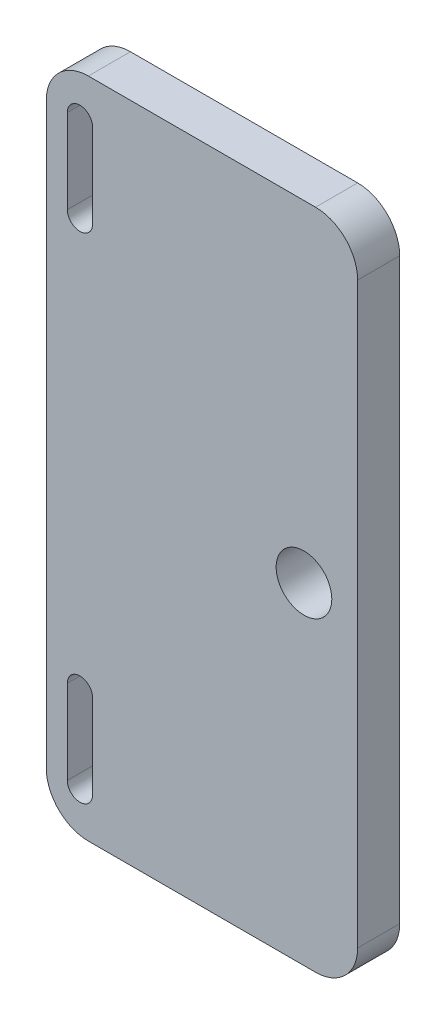
ISO-10303-21;
HEADER;
FILE_DESCRIPTION(('STEP AP214'),'2;1');
FILE_NAME('part.step','',(''),(''),'','','');
FILE_SCHEMA(('AUTOMOTIVE_DESIGN { 1 0 10303 214 1 1 1 1 }'));
ENDSEC;
DATA;
#1=APPLICATION_CONTEXT('core data for automotive mechanical design processes');
#2=APPLICATION_PROTOCOL_DEFINITION('international standard','automotive_design',2000,#1);
#3=PRODUCT_CONTEXT('',#1,'mechanical');
#4=PRODUCT('Part','Part','',(#3));
#5=PRODUCT_RELATED_PRODUCT_CATEGORY('part','',(#4));
#6=PRODUCT_DEFINITION_FORMATION('','',#4);
#7=PRODUCT_DEFINITION_CONTEXT('part definition',#1,'design');
#8=PRODUCT_DEFINITION('design','',#6,#7);
#9=PRODUCT_DEFINITION_SHAPE('','',#8);
#10=(LENGTH_UNIT() NAMED_UNIT(*) SI_UNIT(.MILLI.,.METRE.));
#11=(NAMED_UNIT(*) PLANE_ANGLE_UNIT() SI_UNIT($,.RADIAN.));
#12=(NAMED_UNIT(*) SI_UNIT($,.STERADIAN.) SOLID_ANGLE_UNIT());
#13=UNCERTAINTY_MEASURE_WITH_UNIT(LENGTH_MEASURE(1.E-05),#10,'distance_accuracy_value','');
#14=(GEOMETRIC_REPRESENTATION_CONTEXT(3) GLOBAL_UNCERTAINTY_ASSIGNED_CONTEXT((#13)) GLOBAL_UNIT_ASSIGNED_CONTEXT((#10,
#11,#12)) REPRESENTATION_CONTEXT('',''));
#15=CARTESIAN_POINT('',(0.,0.,0.));
#16=DIRECTION('',(0.,0.,1.));
#17=DIRECTION('',(1.,0.,0.));
#18=AXIS2_PLACEMENT_3D('',#15,#16,#17);
#19=CARTESIAN_POINT('',(0.,0.,3.175));
#20=DIRECTION('',(0.,0.,-1.));
#21=DIRECTION('',(-1.,0.,0.));
#22=AXIS2_PLACEMENT_3D('',#19,#20,#21);
#23=PLANE('',#22);
#24=DIRECTION('',(0.,-1.,0.));
#25=VECTOR('',#24,1.);
#26=CARTESIAN_POINT('',(-27.8575,-15.475,3.175));
#27=LINE('',#26,#25);
#28=CARTESIAN_POINT('',(-27.8575,-15.475,3.175));
#29=VERTEX_POINT('',#28);
#30=CARTESIAN_POINT('',(-27.8575,-21.825,3.175));
#31=VERTEX_POINT('',#30);
#32=EDGE_CURVE('E190',#29,#31,#27,.T.);
#33=ORIENTED_EDGE('',*,*,#32,.F.);
#34=CARTESIAN_POINT('',(-26.905,-15.475,3.175));
#35=DIRECTION('',(0.,0.,1.));
#36=DIRECTION('',(1.,0.,0.));
#37=AXIS2_PLACEMENT_3D('',#34,#35,#36);
#38=CIRCLE('',#37,0.952499999999998);
#39=CARTESIAN_POINT('',(-25.9525,-15.475,3.175));
#40=VERTEX_POINT('',#39);
#41=EDGE_CURVE('E163',#40,#29,#38,.T.);
#42=ORIENTED_EDGE('',*,*,#41,.F.);
#43=DIRECTION('',(0.,1.,0.));
#44=VECTOR('',#43,1.);
#45=CARTESIAN_POINT('',(-25.9525,-15.475,3.175));
#46=LINE('',#45,#44);
#47=CARTESIAN_POINT('',(-25.9525,-21.825,3.175));
#48=VERTEX_POINT('',#47);
#49=EDGE_CURVE('E181',#48,#40,#46,.T.);
#50=ORIENTED_EDGE('',*,*,#49,.F.);
#51=CARTESIAN_POINT('',(-26.905,-21.825,3.175));
#52=DIRECTION('',(0.,0.,1.));
#53=DIRECTION('',(1.,0.,0.));
#54=AXIS2_PLACEMENT_3D('',#51,#52,#53);
#55=CIRCLE('',#54,0.952499999999998);
#56=EDGE_CURVE('E184',#31,#48,#55,.T.);
#57=ORIENTED_EDGE('',*,*,#56,.F.);
#58=EDGE_LOOP('',(#33,#42,#50,#57));
#59=FACE_BOUND('',#58,.T.);
#60=DIRECTION('',(0.,1.,0.));
#61=VECTOR('',#60,1.);
#62=CARTESIAN_POINT('',(-25.9525,15.475,3.175));
#63=LINE('',#62,#61);
#64=CARTESIAN_POINT('',(-25.9525,15.475,3.175));
#65=VERTEX_POINT('',#64);
#66=CARTESIAN_POINT('',(-25.9525000000001,21.825,3.175));
#67=VERTEX_POINT('',#66);
#68=EDGE_CURVE('E218',#65,#67,#63,.T.);
#69=ORIENTED_EDGE('',*,*,#68,.F.);
#70=CARTESIAN_POINT('',(-26.905,15.475,3.175));
#71=DIRECTION('',(0.,0.,1.));
#72=DIRECTION('',(-1.,0.,0.));
#73=AXIS2_PLACEMENT_3D('',#70,#71,#72);
#74=CIRCLE('',#73,0.952499999999998);
#75=CARTESIAN_POINT('',(-27.8575,15.475,3.175));
#76=VERTEX_POINT('',#75);
#77=EDGE_CURVE('E191',#76,#65,#74,.T.);
#78=ORIENTED_EDGE('',*,*,#77,.F.);
#79=DIRECTION('',(0.,-1.,0.));
#80=VECTOR('',#79,1.);
#81=CARTESIAN_POINT('',(-27.8575,15.475,3.175));
#82=LINE('',#81,#80);
#83=CARTESIAN_POINT('',(-27.8575000000001,21.825,3.175));
#84=VERTEX_POINT('',#83);
#85=EDGE_CURVE('E211',#84,#76,#82,.T.);
#86=ORIENTED_EDGE('',*,*,#85,.F.);
#87=CARTESIAN_POINT('',(-26.9050000000001,21.825,3.175));
#88=DIRECTION('',(0.,0.,1.));
#89=DIRECTION('',(-1.,0.,0.));
#90=AXIS2_PLACEMENT_3D('',#87,#88,#89);
#91=CIRCLE('',#90,0.952499999999998);
#92=EDGE_CURVE('E214',#67,#84,#91,.T.);
#93=ORIENTED_EDGE('',*,*,#92,.F.);
#94=EDGE_LOOP('',(#69,#78,#86,#93));
#95=FACE_BOUND('',#94,.T.);
#96=DIRECTION('',(0.,-1.,0.));
#97=VECTOR('',#96,1.);
#98=CARTESIAN_POINT('',(-29.445,-25.,3.175));
#99=LINE('',#98,#97);
#100=CARTESIAN_POINT('',(-29.445,21.825,3.175));
#101=VERTEX_POINT('',#100);
#102=CARTESIAN_POINT('',(-29.445,-21.825,3.175));
#103=VERTEX_POINT('',#102);
#104=EDGE_CURVE('E197',#101,#103,#99,.T.);
#105=ORIENTED_EDGE('',*,*,#104,.T.);
#106=CARTESIAN_POINT('',(-26.27,-21.825,3.175));
#107=DIRECTION('',(0.,0.,-1.));
#108=DIRECTION('',(-1.,0.,0.));
#109=AXIS2_PLACEMENT_3D('',#106,#107,#108);
#110=CIRCLE('',#109,3.175);
#111=CARTESIAN_POINT('',(-26.27,-25.,3.175));
#112=VERTEX_POINT('',#111);
#113=EDGE_CURVE('E271',#103,#112,#110,.F.);
#114=ORIENTED_EDGE('',*,*,#113,.T.);
#115=DIRECTION('',(1.,0.,0.));
#116=VECTOR('',#115,1.);
#117=CARTESIAN_POINT('',(-5.94999999999999,-25.,3.175));
#118=LINE('',#117,#116);
#119=CARTESIAN_POINT('',(-9.12499999999999,-25.,3.175));
#120=VERTEX_POINT('',#119);
#121=EDGE_CURVE('E247',#112,#120,#118,.T.);
#122=ORIENTED_EDGE('',*,*,#121,.T.);
#123=CARTESIAN_POINT('',(-9.12499999999999,-21.825,3.175));
#124=DIRECTION('',(0.,0.,-1.));
#125=DIRECTION('',(-1.,0.,0.));
#126=AXIS2_PLACEMENT_3D('',#123,#124,#125);
#127=CIRCLE('',#126,3.175);
#128=CARTESIAN_POINT('',(-5.94999999999999,-21.825,3.175));
#129=VERTEX_POINT('',#128);
#130=EDGE_CURVE('E269',#120,#129,#127,.F.);
#131=ORIENTED_EDGE('',*,*,#130,.T.);
#132=DIRECTION('',(0.,1.,0.));
#133=VECTOR('',#132,1.);
#134=CARTESIAN_POINT('',(-5.95,25.,3.175));
#135=LINE('',#134,#133);
#136=CARTESIAN_POINT('',(-5.95,21.825,3.175));
#137=VERTEX_POINT('',#136);
#138=EDGE_CURVE('E251',#129,#137,#135,.T.);
#139=ORIENTED_EDGE('',*,*,#138,.T.);
#140=CARTESIAN_POINT('',(-9.125,21.825,3.175));
#141=DIRECTION('',(0.,0.,-1.));
#142=DIRECTION('',(-1.,0.,0.));
#143=AXIS2_PLACEMENT_3D('',#140,#141,#142);
#144=CIRCLE('',#143,3.175);
#145=CARTESIAN_POINT('',(-9.12500000000001,25.,3.175));
#146=VERTEX_POINT('',#145);
#147=EDGE_CURVE('E265',#137,#146,#144,.F.);
#148=ORIENTED_EDGE('',*,*,#147,.T.);
#149=DIRECTION('',(-1.,0.,0.));
#150=VECTOR('',#149,1.);
#151=CARTESIAN_POINT('',(-25.,25.,3.175));
#152=LINE('',#151,#150);
#153=CARTESIAN_POINT('',(-26.27,25.,3.175));
#154=VERTEX_POINT('',#153);
#155=EDGE_CURVE('E244',#146,#154,#152,.T.);
#156=ORIENTED_EDGE('',*,*,#155,.T.);
#157=CARTESIAN_POINT('',(-26.27,21.825,3.175));
#158=DIRECTION('',(0.,0.,-1.));
#159=DIRECTION('',(-1.,0.,0.));
#160=AXIS2_PLACEMENT_3D('',#157,#158,#159);
#161=CIRCLE('',#160,3.175);
#162=EDGE_CURVE('E267',#154,#101,#161,.F.);
#163=ORIENTED_EDGE('',*,*,#162,.T.);
#164=EDGE_LOOP('',(#105,#114,#122,#131,#139,#148,#156,#163));
#165=FACE_BOUND('',#164,.T.);
#166=CARTESIAN_POINT('',(-10.,0.,3.175));
#167=DIRECTION('',(0.,0.,1.));
#168=DIRECTION('',(1.,0.,0.));
#169=AXIS2_PLACEMENT_3D('',#166,#167,#168);
#170=CIRCLE('',#169,2.1);
#171=CARTESIAN_POINT('',(-7.9,0.,3.175));
#172=VERTEX_POINT('',#171);
#173=EDGE_CURVE('E238',#172,#172,#170,.T.);
#174=ORIENTED_EDGE('',*,*,#173,.F.);
#175=EDGE_LOOP('',(#174));
#176=FACE_BOUND('',#175,.T.);
#177=ADVANCED_FACE('F41',(#59,#95,#165,#176),#23,.F.);
#178=CARTESIAN_POINT('',(0.,0.,0.));
#179=DIRECTION('',(0.,0.,-1.));
#180=DIRECTION('',(-1.,0.,0.));
#181=AXIS2_PLACEMENT_3D('',#178,#179,#180);
#182=PLANE('',#181);
#183=CARTESIAN_POINT('',(-26.905,-15.475,0.));
#184=DIRECTION('',(0.,0.,1.));
#185=DIRECTION('',(1.,0.,0.));
#186=AXIS2_PLACEMENT_3D('',#183,#184,#185);
#187=CIRCLE('',#186,0.952499999999998);
#188=CARTESIAN_POINT('',(-25.9525,-15.475,0.));
#189=VERTEX_POINT('',#188);
#190=CARTESIAN_POINT('',(-27.8575,-15.475,0.));
#191=VERTEX_POINT('',#190);
#192=EDGE_CURVE('E160',#189,#191,#187,.T.);
#193=ORIENTED_EDGE('',*,*,#192,.T.);
#194=DIRECTION('',(0.,-1.,0.));
#195=VECTOR('',#194,1.);
#196=CARTESIAN_POINT('',(-27.8575,-15.475,0.));
#197=LINE('',#196,#195);
#198=CARTESIAN_POINT('',(-27.8575,-21.825,0.));
#199=VERTEX_POINT('',#198);
#200=EDGE_CURVE('E172',#191,#199,#197,.T.);
#201=ORIENTED_EDGE('',*,*,#200,.T.);
#202=CARTESIAN_POINT('',(-26.905,-21.825,0.));
#203=DIRECTION('',(0.,0.,1.));
#204=DIRECTION('',(1.,0.,0.));
#205=AXIS2_PLACEMENT_3D('',#202,#203,#204);
#206=CIRCLE('',#205,0.952499999999998);
#207=CARTESIAN_POINT('',(-25.9525,-21.825,0.));
#208=VERTEX_POINT('',#207);
#209=EDGE_CURVE('E176',#199,#208,#206,.T.);
#210=ORIENTED_EDGE('',*,*,#209,.T.);
#211=DIRECTION('',(0.,1.,0.));
#212=VECTOR('',#211,1.);
#213=CARTESIAN_POINT('',(-25.9525,-15.475,0.));
#214=LINE('',#213,#212);
#215=EDGE_CURVE('E168',#208,#189,#214,.T.);
#216=ORIENTED_EDGE('',*,*,#215,.T.);
#217=EDGE_LOOP('',(#193,#201,#210,#216));
#218=FACE_BOUND('',#217,.T.);
#219=CARTESIAN_POINT('',(-26.905,15.475,0.));
#220=DIRECTION('',(0.,0.,1.));
#221=DIRECTION('',(-1.,0.,0.));
#222=AXIS2_PLACEMENT_3D('',#219,#220,#221);
#223=CIRCLE('',#222,0.952499999999998);
#224=CARTESIAN_POINT('',(-27.8575,15.475,0.));
#225=VERTEX_POINT('',#224);
#226=CARTESIAN_POINT('',(-25.9525,15.475,0.));
#227=VERTEX_POINT('',#226);
#228=EDGE_CURVE('E215',#225,#227,#223,.T.);
#229=ORIENTED_EDGE('',*,*,#228,.T.);
#230=DIRECTION('',(0.,1.,0.));
#231=VECTOR('',#230,1.);
#232=CARTESIAN_POINT('',(-25.9525,15.475,0.));
#233=LINE('',#232,#231);
#234=CARTESIAN_POINT('',(-25.9525000000001,21.825,0.));
#235=VERTEX_POINT('',#234);
#236=EDGE_CURVE('E227',#227,#235,#233,.T.);
#237=ORIENTED_EDGE('',*,*,#236,.T.);
#238=CARTESIAN_POINT('',(-26.9050000000001,21.825,0.));
#239=DIRECTION('',(0.,0.,1.));
#240=DIRECTION('',(-1.,0.,0.));
#241=AXIS2_PLACEMENT_3D('',#238,#239,#240);
#242=CIRCLE('',#241,0.952499999999998);
#243=CARTESIAN_POINT('',(-27.8575000000001,21.825,0.));
#244=VERTEX_POINT('',#243);
#245=EDGE_CURVE('E224',#235,#244,#242,.T.);
#246=ORIENTED_EDGE('',*,*,#245,.T.);
#247=DIRECTION('',(0.,-1.,0.));
#248=VECTOR('',#247,1.);
#249=CARTESIAN_POINT('',(-27.8575,15.475,0.));
#250=LINE('',#249,#248);
#251=EDGE_CURVE('E204',#244,#225,#250,.T.);
#252=ORIENTED_EDGE('',*,*,#251,.T.);
#253=EDGE_LOOP('',(#229,#237,#246,#252));
#254=FACE_BOUND('',#253,.T.);
#255=DIRECTION('',(1.,0.,0.));
#256=VECTOR('',#255,1.);
#257=CARTESIAN_POINT('',(-5.94999999999999,-25.,0.));
#258=LINE('',#257,#256);
#259=CARTESIAN_POINT('',(-26.27,-25.,0.));
#260=VERTEX_POINT('',#259);
#261=CARTESIAN_POINT('',(-9.12499999999999,-25.,0.));
#262=VERTEX_POINT('',#261);
#263=EDGE_CURVE('E257',#260,#262,#258,.T.);
#264=ORIENTED_EDGE('',*,*,#263,.F.);
#265=CARTESIAN_POINT('',(-26.27,-21.825,0.));
#266=DIRECTION('',(0.,0.,-1.));
#267=DIRECTION('',(-1.,0.,0.));
#268=AXIS2_PLACEMENT_3D('',#265,#266,#267);
#269=CIRCLE('',#268,3.175);
#270=CARTESIAN_POINT('',(-29.445,-21.825,0.));
#271=VERTEX_POINT('',#270);
#272=EDGE_CURVE('E281',#260,#271,#269,.T.);
#273=ORIENTED_EDGE('',*,*,#272,.T.);
#274=DIRECTION('',(0.,-1.,0.));
#275=VECTOR('',#274,1.);
#276=CARTESIAN_POINT('',(-29.445,-25.,0.));
#277=LINE('',#276,#275);
#278=CARTESIAN_POINT('',(-29.445,21.825,0.));
#279=VERTEX_POINT('',#278);
#280=EDGE_CURVE('E232',#279,#271,#277,.T.);
#281=ORIENTED_EDGE('',*,*,#280,.F.);
#282=CARTESIAN_POINT('',(-26.27,21.825,0.));
#283=DIRECTION('',(0.,0.,-1.));
#284=DIRECTION('',(-1.,0.,0.));
#285=AXIS2_PLACEMENT_3D('',#282,#283,#284);
#286=CIRCLE('',#285,3.175);
#287=CARTESIAN_POINT('',(-26.27,25.,0.));
#288=VERTEX_POINT('',#287);
#289=EDGE_CURVE('E278',#279,#288,#286,.T.);
#290=ORIENTED_EDGE('',*,*,#289,.T.);
#291=DIRECTION('',(-1.,0.,0.));
#292=VECTOR('',#291,1.);
#293=CARTESIAN_POINT('',(-25.,25.,0.));
#294=LINE('',#293,#292);
#295=CARTESIAN_POINT('',(-9.12500000000001,25.,0.));
#296=VERTEX_POINT('',#295);
#297=EDGE_CURVE('E241',#296,#288,#294,.T.);
#298=ORIENTED_EDGE('',*,*,#297,.F.);
#299=CARTESIAN_POINT('',(-9.125,21.825,0.));
#300=DIRECTION('',(0.,0.,-1.));
#301=DIRECTION('',(-1.,0.,0.));
#302=AXIS2_PLACEMENT_3D('',#299,#300,#301);
#303=CIRCLE('',#302,3.175);
#304=CARTESIAN_POINT('',(-5.95,21.825,0.));
#305=VERTEX_POINT('',#304);
#306=EDGE_CURVE('E56',#296,#305,#303,.T.);
#307=ORIENTED_EDGE('',*,*,#306,.T.);
#308=DIRECTION('',(0.,1.,0.));
#309=VECTOR('',#308,1.);
#310=CARTESIAN_POINT('',(-5.95,25.,0.));
#311=LINE('',#310,#309);
#312=CARTESIAN_POINT('',(-5.94999999999999,-21.825,0.));
#313=VERTEX_POINT('',#312);
#314=EDGE_CURVE('E248',#313,#305,#311,.T.);
#315=ORIENTED_EDGE('',*,*,#314,.F.);
#316=CARTESIAN_POINT('',(-9.12499999999999,-21.825,0.));
#317=DIRECTION('',(0.,0.,-1.));
#318=DIRECTION('',(-1.,0.,0.));
#319=AXIS2_PLACEMENT_3D('',#316,#317,#318);
#320=CIRCLE('',#319,3.175);
#321=EDGE_CURVE('E64',#313,#262,#320,.T.);
#322=ORIENTED_EDGE('',*,*,#321,.T.);
#323=EDGE_LOOP('',(#264,#273,#281,#290,#298,#307,#315,#322));
#324=FACE_BOUND('',#323,.T.);
#325=CARTESIAN_POINT('',(-10.,0.,0.));
#326=DIRECTION('',(0.,0.,1.));
#327=DIRECTION('',(1.,0.,0.));
#328=AXIS2_PLACEMENT_3D('',#325,#326,#327);
#329=CIRCLE('',#328,2.1);
#330=CARTESIAN_POINT('',(-7.9,0.,0.));
#331=VERTEX_POINT('',#330);
#332=EDGE_CURVE('E235',#331,#331,#329,.T.);
#333=ORIENTED_EDGE('',*,*,#332,.T.);
#334=EDGE_LOOP('',(#333));
#335=FACE_BOUND('',#334,.T.);
#336=ADVANCED_FACE('F178',(#218,#254,#324,#335),#182,.T.);
#337=CARTESIAN_POINT('',(-25.,25.,3.175));
#338=DIRECTION('',(0.,-1.,0.));
#339=DIRECTION('',(0.,0.,-1.));
#340=AXIS2_PLACEMENT_3D('',#337,#338,#339);
#341=PLANE('',#340);
#342=ORIENTED_EDGE('',*,*,#297,.T.);
#343=DIRECTION('',(0.,0.,1.));
#344=VECTOR('',#343,1.);
#345=CARTESIAN_POINT('',(-26.27,25.,3.175));
#346=LINE('',#345,#344);
#347=EDGE_CURVE('E11',#288,#154,#346,.T.);
#348=ORIENTED_EDGE('',*,*,#347,.T.);
#349=ORIENTED_EDGE('',*,*,#155,.F.);
#350=DIRECTION('',(0.,0.,-1.));
#351=VECTOR('',#350,1.);
#352=CARTESIAN_POINT('',(-9.125,25.,3.175));
#353=LINE('',#352,#351);
#354=EDGE_CURVE('E49',#146,#296,#353,.T.);
#355=ORIENTED_EDGE('',*,*,#354,.T.);
#356=EDGE_LOOP('',(#342,#348,#349,#355));
#357=FACE_BOUND('',#356,.T.);
#358=ADVANCED_FACE('F290',(#357),#341,.F.);
#359=CARTESIAN_POINT('',(-5.94999999999999,-25.,3.175));
#360=DIRECTION('',(0.,1.,0.));
#361=DIRECTION('',(-1.,0.,0.));
#362=AXIS2_PLACEMENT_3D('',#359,#360,#361);
#363=PLANE('',#362);
#364=ORIENTED_EDGE('',*,*,#121,.F.);
#365=DIRECTION('',(0.,0.,1.));
#366=VECTOR('',#365,1.);
#367=CARTESIAN_POINT('',(-26.27,-25.,0.));
#368=LINE('',#367,#366);
#369=EDGE_CURVE('E275',#112,#260,#368,.F.);
#370=ORIENTED_EDGE('',*,*,#369,.T.);
#371=ORIENTED_EDGE('',*,*,#263,.T.);
#372=DIRECTION('',(0.,0.,-1.));
#373=VECTOR('',#372,1.);
#374=CARTESIAN_POINT('',(-9.12499999999999,-25.,3.175));
#375=LINE('',#374,#373);
#376=EDGE_CURVE('E273',#262,#120,#375,.F.);
#377=ORIENTED_EDGE('',*,*,#376,.T.);
#378=EDGE_LOOP('',(#364,#370,#371,#377));
#379=FACE_BOUND('',#378,.T.);
#380=ADVANCED_FACE('F311',(#379),#363,.F.);
#381=CARTESIAN_POINT('',(-5.95,25.,3.175));
#382=DIRECTION('',(-1.,0.,0.));
#383=DIRECTION('',(0.,-1.,0.));
#384=AXIS2_PLACEMENT_3D('',#381,#382,#383);
#385=PLANE('',#384);
#386=ORIENTED_EDGE('',*,*,#138,.F.);
#387=DIRECTION('',(0.,0.,-1.));
#388=VECTOR('',#387,1.);
#389=CARTESIAN_POINT('',(-5.94999999999999,-21.825,3.175));
#390=LINE('',#389,#388);
#391=EDGE_CURVE('E285',#129,#313,#390,.T.);
#392=ORIENTED_EDGE('',*,*,#391,.T.);
#393=ORIENTED_EDGE('',*,*,#314,.T.);
#394=DIRECTION('',(0.,0.,-1.));
#395=VECTOR('',#394,1.);
#396=CARTESIAN_POINT('',(-5.95,21.825,3.175));
#397=LINE('',#396,#395);
#398=EDGE_CURVE('E283',#305,#137,#397,.F.);
#399=ORIENTED_EDGE('',*,*,#398,.T.);
#400=EDGE_LOOP('',(#386,#392,#393,#399));
#401=FACE_BOUND('',#400,.T.);
#402=ADVANCED_FACE('F307',(#401),#385,.F.);
#403=CARTESIAN_POINT('',(-10.,0.,3.175));
#404=DIRECTION('',(0.,0.,-1.));
#405=DIRECTION('',(-1.,0.,0.));
#406=AXIS2_PLACEMENT_3D('',#403,#404,#405);
#407=CYLINDRICAL_SURFACE('',#406,2.1);
#408=ORIENTED_EDGE('',*,*,#173,.T.);
#409=EDGE_LOOP('',(#408));
#410=FACE_BOUND('',#409,.T.);
#411=ORIENTED_EDGE('',*,*,#332,.F.);
#412=EDGE_LOOP('',(#411));
#413=FACE_BOUND('',#412,.T.);
#414=ADVANCED_FACE('F322',(#410,#413),#407,.F.);
#415=CARTESIAN_POINT('',(-29.445,-25.,0.));
#416=DIRECTION('',(-1.,0.,0.));
#417=DIRECTION('',(0.,0.,1.));
#418=AXIS2_PLACEMENT_3D('',#415,#416,#417);
#419=PLANE('',#418);
#420=ORIENTED_EDGE('',*,*,#280,.T.);
#421=DIRECTION('',(0.,0.,1.));
#422=VECTOR('',#421,1.);
#423=CARTESIAN_POINT('',(-29.445,-21.825,3.175));
#424=LINE('',#423,#422);
#425=EDGE_CURVE('E262',#271,#103,#424,.T.);
#426=ORIENTED_EDGE('',*,*,#425,.T.);
#427=ORIENTED_EDGE('',*,*,#104,.F.);
#428=DIRECTION('',(0.,0.,1.));
#429=VECTOR('',#428,1.);
#430=CARTESIAN_POINT('',(-29.445,21.825,0.));
#431=LINE('',#430,#429);
#432=EDGE_CURVE('E254',#101,#279,#431,.F.);
#433=ORIENTED_EDGE('',*,*,#432,.T.);
#434=EDGE_LOOP('',(#420,#426,#427,#433));
#435=FACE_BOUND('',#434,.T.);
#436=ADVANCED_FACE('F319',(#435),#419,.T.);
#437=CARTESIAN_POINT('',(-26.905,15.475,0.));
#438=DIRECTION('',(0.,0.,1.));
#439=DIRECTION('',(1.,0.,0.));
#440=AXIS2_PLACEMENT_3D('',#437,#438,#439);
#441=CYLINDRICAL_SURFACE('',#440,0.952499999999998);
#442=ORIENTED_EDGE('',*,*,#77,.T.);
#443=DIRECTION('',(0.,0.,1.));
#444=VECTOR('',#443,1.);
#445=CARTESIAN_POINT('',(-25.9525,15.475,0.));
#446=LINE('',#445,#444);
#447=EDGE_CURVE('E201',#227,#65,#446,.T.);
#448=ORIENTED_EDGE('',*,*,#447,.F.);
#449=ORIENTED_EDGE('',*,*,#228,.F.);
#450=DIRECTION('',(0.,0.,1.));
#451=VECTOR('',#450,1.);
#452=CARTESIAN_POINT('',(-27.8575,15.475,0.));
#453=LINE('',#452,#451);
#454=EDGE_CURVE('E209',#225,#76,#453,.T.);
#455=ORIENTED_EDGE('',*,*,#454,.T.);
#456=EDGE_LOOP('',(#442,#448,#449,#455));
#457=FACE_BOUND('',#456,.T.);
#458=ADVANCED_FACE('F321',(#457),#441,.F.);
#459=CARTESIAN_POINT('',(-27.8575,15.475,0.));
#460=DIRECTION('',(-1.,0.,0.));
#461=DIRECTION('',(0.,-1.,0.));
#462=AXIS2_PLACEMENT_3D('',#459,#460,#461);
#463=PLANE('',#462);
#464=ORIENTED_EDGE('',*,*,#85,.T.);
#465=ORIENTED_EDGE('',*,*,#454,.F.);
#466=ORIENTED_EDGE('',*,*,#251,.F.);
#467=DIRECTION('',(0.,0.,1.));
#468=VECTOR('',#467,1.);
#469=CARTESIAN_POINT('',(-27.8575000000001,21.825,0.));
#470=LINE('',#469,#468);
#471=EDGE_CURVE('E207',#244,#84,#470,.T.);
#472=ORIENTED_EDGE('',*,*,#471,.T.);
#473=EDGE_LOOP('',(#464,#465,#466,#472));
#474=FACE_BOUND('',#473,.T.);
#475=ADVANCED_FACE('F329',(#474),#463,.F.);
#476=CARTESIAN_POINT('',(-26.9050000000001,21.825,0.));
#477=DIRECTION('',(0.,0.,1.));
#478=DIRECTION('',(1.,0.,0.));
#479=AXIS2_PLACEMENT_3D('',#476,#477,#478);
#480=CYLINDRICAL_SURFACE('',#479,0.952499999999998);
#481=ORIENTED_EDGE('',*,*,#92,.T.);
#482=ORIENTED_EDGE('',*,*,#471,.F.);
#483=ORIENTED_EDGE('',*,*,#245,.F.);
#484=DIRECTION('',(0.,0.,1.));
#485=VECTOR('',#484,1.);
#486=CARTESIAN_POINT('',(-25.9525000000001,21.825,0.));
#487=LINE('',#486,#485);
#488=EDGE_CURVE('E205',#235,#67,#487,.T.);
#489=ORIENTED_EDGE('',*,*,#488,.T.);
#490=EDGE_LOOP('',(#481,#482,#483,#489));
#491=FACE_BOUND('',#490,.T.);
#492=ADVANCED_FACE('F421',(#491),#480,.F.);
#493=CARTESIAN_POINT('',(-25.9525,15.475,0.));
#494=DIRECTION('',(1.,0.,0.));
#495=DIRECTION('',(0.,1.,0.));
#496=AXIS2_PLACEMENT_3D('',#493,#494,#495);
#497=PLANE('',#496);
#498=ORIENTED_EDGE('',*,*,#68,.T.);
#499=ORIENTED_EDGE('',*,*,#488,.F.);
#500=ORIENTED_EDGE('',*,*,#236,.F.);
#501=ORIENTED_EDGE('',*,*,#447,.T.);
#502=EDGE_LOOP('',(#498,#499,#500,#501));
#503=FACE_BOUND('',#502,.T.);
#504=ADVANCED_FACE('F412',(#503),#497,.F.);
#505=CARTESIAN_POINT('',(-26.905,-15.475,0.));
#506=DIRECTION('',(0.,0.,1.));
#507=DIRECTION('',(1.,0.,0.));
#508=AXIS2_PLACEMENT_3D('',#505,#506,#507);
#509=CYLINDRICAL_SURFACE('',#508,0.952499999999998);
#510=ORIENTED_EDGE('',*,*,#41,.T.);
#511=DIRECTION('',(0.,0.,1.));
#512=VECTOR('',#511,1.);
#513=CARTESIAN_POINT('',(-27.8575,-15.475,0.));
#514=LINE('',#513,#512);
#515=EDGE_CURVE('E156',#191,#29,#514,.T.);
#516=ORIENTED_EDGE('',*,*,#515,.F.);
#517=ORIENTED_EDGE('',*,*,#192,.F.);
#518=DIRECTION('',(0.,0.,1.));
#519=VECTOR('',#518,1.);
#520=CARTESIAN_POINT('',(-25.9525,-15.475,0.));
#521=LINE('',#520,#519);
#522=EDGE_CURVE('E195',#189,#40,#521,.T.);
#523=ORIENTED_EDGE('',*,*,#522,.T.);
#524=EDGE_LOOP('',(#510,#516,#517,#523));
#525=FACE_BOUND('',#524,.T.);
#526=ADVANCED_FACE('F158',(#525),#509,.F.);
#527=CARTESIAN_POINT('',(-25.9525,-15.475,0.));
#528=DIRECTION('',(1.,0.,0.));
#529=DIRECTION('',(0.,0.,-1.));
#530=AXIS2_PLACEMENT_3D('',#527,#528,#529);
#531=PLANE('',#530);
#532=ORIENTED_EDGE('',*,*,#49,.T.);
#533=ORIENTED_EDGE('',*,*,#522,.F.);
#534=ORIENTED_EDGE('',*,*,#215,.F.);
#535=DIRECTION('',(0.,0.,1.));
#536=VECTOR('',#535,1.);
#537=CARTESIAN_POINT('',(-25.9525,-21.825,0.));
#538=LINE('',#537,#536);
#539=EDGE_CURVE('E198',#208,#48,#538,.T.);
#540=ORIENTED_EDGE('',*,*,#539,.T.);
#541=EDGE_LOOP('',(#532,#533,#534,#540));
#542=FACE_BOUND('',#541,.T.);
#543=ADVANCED_FACE('F393',(#542),#531,.F.);
#544=CARTESIAN_POINT('',(-26.905,-21.825,0.));
#545=DIRECTION('',(0.,0.,1.));
#546=DIRECTION('',(1.,0.,0.));
#547=AXIS2_PLACEMENT_3D('',#544,#545,#546);
#548=CYLINDRICAL_SURFACE('',#547,0.952499999999998);
#549=ORIENTED_EDGE('',*,*,#56,.T.);
#550=ORIENTED_EDGE('',*,*,#539,.F.);
#551=ORIENTED_EDGE('',*,*,#209,.F.);
#552=DIRECTION('',(0.,0.,1.));
#553=VECTOR('',#552,1.);
#554=CARTESIAN_POINT('',(-27.8575,-21.825,0.));
#555=LINE('',#554,#553);
#556=EDGE_CURVE('E167',#199,#31,#555,.T.);
#557=ORIENTED_EDGE('',*,*,#556,.T.);
#558=EDGE_LOOP('',(#549,#550,#551,#557));
#559=FACE_BOUND('',#558,.T.);
#560=ADVANCED_FACE('F384',(#559),#548,.F.);
#561=CARTESIAN_POINT('',(-27.8575,-15.475,0.));
#562=DIRECTION('',(-1.,0.,0.));
#563=DIRECTION('',(0.,0.,1.));
#564=AXIS2_PLACEMENT_3D('',#561,#562,#563);
#565=PLANE('',#564);
#566=ORIENTED_EDGE('',*,*,#32,.T.);
#567=ORIENTED_EDGE('',*,*,#556,.F.);
#568=ORIENTED_EDGE('',*,*,#200,.F.);
#569=ORIENTED_EDGE('',*,*,#515,.T.);
#570=EDGE_LOOP('',(#566,#567,#568,#569));
#571=FACE_BOUND('',#570,.T.);
#572=ADVANCED_FACE('F173',(#571),#565,.F.);
#573=CARTESIAN_POINT('',(-26.27,-21.825,0.));
#574=DIRECTION('',(0.,0.,-1.));
#575=DIRECTION('',(-1.,0.,0.));
#576=AXIS2_PLACEMENT_3D('',#573,#574,#575);
#577=CYLINDRICAL_SURFACE('',#576,3.175);
#578=ORIENTED_EDGE('',*,*,#272,.F.);
#579=ORIENTED_EDGE('',*,*,#369,.F.);
#580=ORIENTED_EDGE('',*,*,#113,.F.);
#581=ORIENTED_EDGE('',*,*,#425,.F.);
#582=EDGE_LOOP('',(#578,#579,#580,#581));
#583=FACE_BOUND('',#582,.T.);
#584=ADVANCED_FACE('F316',(#583),#577,.T.);
#585=CARTESIAN_POINT('',(-9.12499999999999,-21.825,3.175));
#586=DIRECTION('',(0.,0.,-1.));
#587=DIRECTION('',(-1.,0.,0.));
#588=AXIS2_PLACEMENT_3D('',#585,#586,#587);
#589=CYLINDRICAL_SURFACE('',#588,3.175);
#590=ORIENTED_EDGE('',*,*,#130,.F.);
#591=ORIENTED_EDGE('',*,*,#376,.F.);
#592=ORIENTED_EDGE('',*,*,#321,.F.);
#593=ORIENTED_EDGE('',*,*,#391,.F.);
#594=EDGE_LOOP('',(#590,#591,#592,#593));
#595=FACE_BOUND('',#594,.T.);
#596=ADVANCED_FACE('F314',(#595),#589,.T.);
#597=CARTESIAN_POINT('',(-26.27,21.825,3.175));
#598=DIRECTION('',(0.,0.,-1.));
#599=DIRECTION('',(-1.,0.,0.));
#600=AXIS2_PLACEMENT_3D('',#597,#598,#599);
#601=CYLINDRICAL_SURFACE('',#600,3.175);
#602=ORIENTED_EDGE('',*,*,#289,.F.);
#603=ORIENTED_EDGE('',*,*,#432,.F.);
#604=ORIENTED_EDGE('',*,*,#162,.F.);
#605=ORIENTED_EDGE('',*,*,#347,.F.);
#606=EDGE_LOOP('',(#602,#603,#604,#605));
#607=FACE_BOUND('',#606,.T.);
#608=ADVANCED_FACE('F300',(#607),#601,.T.);
#609=CARTESIAN_POINT('',(-9.125,21.825,3.175));
#610=DIRECTION('',(0.,0.,-1.));
#611=DIRECTION('',(-1.,0.,0.));
#612=AXIS2_PLACEMENT_3D('',#609,#610,#611);
#613=CYLINDRICAL_SURFACE('',#612,3.175);
#614=ORIENTED_EDGE('',*,*,#147,.F.);
#615=ORIENTED_EDGE('',*,*,#398,.F.);
#616=ORIENTED_EDGE('',*,*,#306,.F.);
#617=ORIENTED_EDGE('',*,*,#354,.F.);
#618=EDGE_LOOP('',(#614,#615,#616,#617));
#619=FACE_BOUND('',#618,.T.);
#620=ADVANCED_FACE('F43',(#619),#613,.T.);
#621=CLOSED_SHELL('',(#177,#336,#358,#380,#402,#414,#436,#458,#475,#492,#504,#526,#543,#560,
#572,#584,#596,#608,#620));
#622=MANIFOLD_SOLID_BREP('B2',#621);
#623=ADVANCED_BREP_SHAPE_REPRESENTATION('',(#18,#622),#14);
#624=SHAPE_DEFINITION_REPRESENTATION(#9,#623);
ENDSEC;
END-ISO-10303-21;
